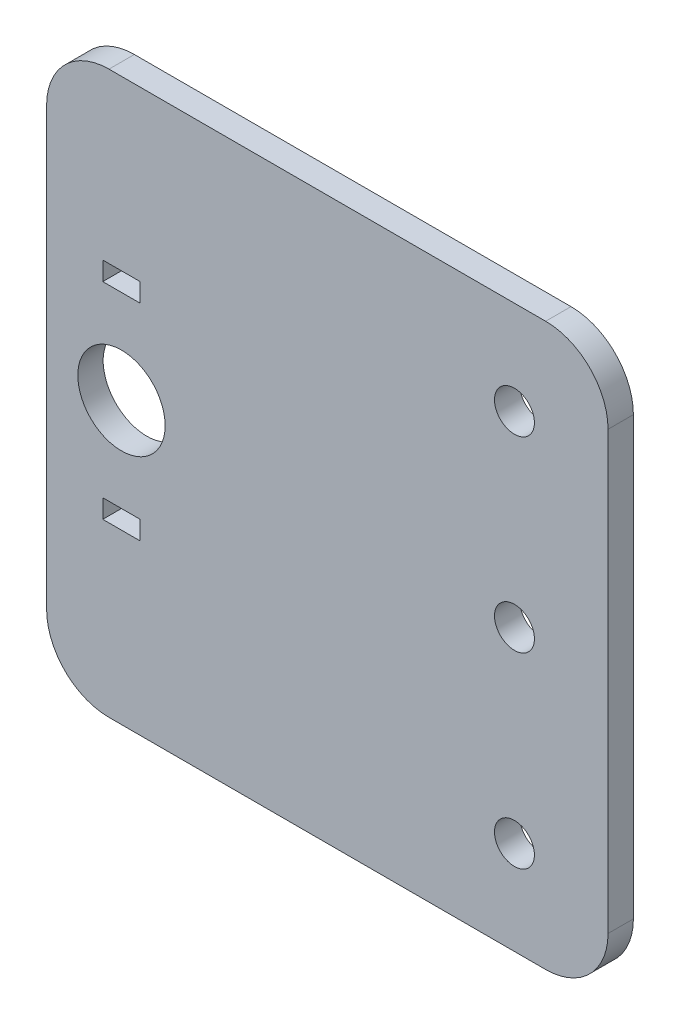
ISO-10303-21;
HEADER;
FILE_DESCRIPTION(('STEP AP214'),'2;1');
FILE_NAME('part.step','',(''),(''),'','','');
FILE_SCHEMA(('AUTOMOTIVE_DESIGN { 1 0 10303 214 1 1 1 1 }'));
ENDSEC;
DATA;
#1=APPLICATION_CONTEXT('core data for automotive mechanical design processes');
#2=APPLICATION_PROTOCOL_DEFINITION('international standard','automotive_design',2000,#1);
#3=PRODUCT_CONTEXT('',#1,'mechanical');
#4=PRODUCT('Part','Part','',(#3));
#5=PRODUCT_RELATED_PRODUCT_CATEGORY('part','',(#4));
#6=PRODUCT_DEFINITION_FORMATION('','',#4);
#7=PRODUCT_DEFINITION_CONTEXT('part definition',#1,'design');
#8=PRODUCT_DEFINITION('design','',#6,#7);
#9=PRODUCT_DEFINITION_SHAPE('','',#8);
#10=(LENGTH_UNIT() NAMED_UNIT(*) SI_UNIT(.MILLI.,.METRE.));
#11=(NAMED_UNIT(*) PLANE_ANGLE_UNIT() SI_UNIT($,.RADIAN.));
#12=(NAMED_UNIT(*) SI_UNIT($,.STERADIAN.) SOLID_ANGLE_UNIT());
#13=UNCERTAINTY_MEASURE_WITH_UNIT(LENGTH_MEASURE(1.E-05),#10,'distance_accuracy_value','');
#14=(GEOMETRIC_REPRESENTATION_CONTEXT(3) GLOBAL_UNCERTAINTY_ASSIGNED_CONTEXT((#13)) GLOBAL_UNIT_ASSIGNED_CONTEXT((#10,
#11,#12)) REPRESENTATION_CONTEXT('',''));
#15=CARTESIAN_POINT('',(0.,0.,0.));
#16=DIRECTION('',(0.,0.,1.));
#17=DIRECTION('',(1.,0.,0.));
#18=AXIS2_PLACEMENT_3D('',#15,#16,#17);
#19=CARTESIAN_POINT('',(0.,0.,2.032));
#20=DIRECTION('',(0.,0.,-1.));
#21=DIRECTION('',(-1.,0.,0.));
#22=AXIS2_PLACEMENT_3D('',#19,#20,#21);
#23=PLANE('',#22);
#24=DIRECTION('',(-1.,0.,0.));
#25=VECTOR('',#24,1.);
#26=CARTESIAN_POINT('',(1.5,9.,2.032));
#27=LINE('',#26,#25);
#28=CARTESIAN_POINT('',(1.5,9.,2.032));
#29=VERTEX_POINT('',#28);
#30=CARTESIAN_POINT('',(-1.5,9.,2.032));
#31=VERTEX_POINT('',#30);
#32=EDGE_CURVE('E177',#29,#31,#27,.T.);
#33=ORIENTED_EDGE('',*,*,#32,.F.);
#34=DIRECTION('',(0.,-1.,0.));
#35=VECTOR('',#34,1.);
#36=CARTESIAN_POINT('',(1.5,9.,2.032));
#37=LINE('',#36,#35);
#38=CARTESIAN_POINT('',(1.5,7.5,2.032));
#39=VERTEX_POINT('',#38);
#40=EDGE_CURVE('E185',#29,#39,#37,.T.);
#41=ORIENTED_EDGE('',*,*,#40,.T.);
#42=DIRECTION('',(-1.,0.,0.));
#43=VECTOR('',#42,1.);
#44=CARTESIAN_POINT('',(1.5,7.5,2.032));
#45=LINE('',#44,#43);
#46=CARTESIAN_POINT('',(-1.5,7.5,2.032));
#47=VERTEX_POINT('',#46);
#48=EDGE_CURVE('E182',#39,#47,#45,.T.);
#49=ORIENTED_EDGE('',*,*,#48,.T.);
#50=DIRECTION('',(0.,-1.,0.));
#51=VECTOR('',#50,1.);
#52=CARTESIAN_POINT('',(-1.5,9.,2.032));
#53=LINE('',#52,#51);
#54=EDGE_CURVE('E179',#31,#47,#53,.T.);
#55=ORIENTED_EDGE('',*,*,#54,.F.);
#56=EDGE_LOOP('',(#33,#41,#49,#55));
#57=FACE_BOUND('',#56,.T.);
#58=CARTESIAN_POINT('',(31.5,-15.,2.032));
#59=DIRECTION('',(0.,0.,-1.));
#60=DIRECTION('',(-1.,0.,0.));
#61=AXIS2_PLACEMENT_3D('',#58,#59,#60);
#62=CIRCLE('',#61,1.6);
#63=CARTESIAN_POINT('',(29.9,-15.,2.032));
#64=VERTEX_POINT('',#63);
#65=EDGE_CURVE('E209',#64,#64,#62,.T.);
#66=ORIENTED_EDGE('',*,*,#65,.T.);
#67=EDGE_LOOP('',(#66));
#68=FACE_BOUND('',#67,.T.);
#69=CARTESIAN_POINT('',(31.5,0.,2.032));
#70=DIRECTION('',(0.,0.,-1.));
#71=DIRECTION('',(-1.,0.,0.));
#72=AXIS2_PLACEMENT_3D('',#69,#70,#71);
#73=CIRCLE('',#72,1.6);
#74=CARTESIAN_POINT('',(29.9,0.,2.032));
#75=VERTEX_POINT('',#74);
#76=EDGE_CURVE('E215',#75,#75,#73,.T.);
#77=ORIENTED_EDGE('',*,*,#76,.T.);
#78=EDGE_LOOP('',(#77));
#79=FACE_BOUND('',#78,.T.);
#80=CARTESIAN_POINT('',(31.5,15.,2.032));
#81=DIRECTION('',(0.,0.,-1.));
#82=DIRECTION('',(-1.,0.,0.));
#83=AXIS2_PLACEMENT_3D('',#80,#81,#82);
#84=CIRCLE('',#83,1.6);
#85=CARTESIAN_POINT('',(29.9,15.,2.032));
#86=VERTEX_POINT('',#85);
#87=EDGE_CURVE('E221',#86,#86,#84,.T.);
#88=ORIENTED_EDGE('',*,*,#87,.T.);
#89=EDGE_LOOP('',(#88));
#90=FACE_BOUND('',#89,.T.);
#91=DIRECTION('',(0.,1.,0.));
#92=VECTOR('',#91,1.);
#93=CARTESIAN_POINT('',(39.,-22.5,2.032));
#94=LINE('',#93,#92);
#95=CARTESIAN_POINT('',(39.,-17.5,2.032));
#96=VERTEX_POINT('',#95);
#97=CARTESIAN_POINT('',(39.,17.5,2.032));
#98=VERTEX_POINT('',#97);
#99=EDGE_CURVE('E233',#96,#98,#94,.T.);
#100=ORIENTED_EDGE('',*,*,#99,.T.);
#101=CARTESIAN_POINT('',(34.,17.5,2.032));
#102=DIRECTION('',(0.,0.,-1.));
#103=DIRECTION('',(-1.,0.,0.));
#104=AXIS2_PLACEMENT_3D('',#101,#102,#103);
#105=CIRCLE('',#104,5.);
#106=CARTESIAN_POINT('',(34.,22.5,2.032));
#107=VERTEX_POINT('',#106);
#108=EDGE_CURVE('E280',#98,#107,#105,.F.);
#109=ORIENTED_EDGE('',*,*,#108,.T.);
#110=DIRECTION('',(-1.,0.,0.));
#111=VECTOR('',#110,1.);
#112=CARTESIAN_POINT('',(-6.,22.5,2.032));
#113=LINE('',#112,#111);
#114=CARTESIAN_POINT('',(-1.,22.5,2.032));
#115=VERTEX_POINT('',#114);
#116=EDGE_CURVE('E236',#107,#115,#113,.T.);
#117=ORIENTED_EDGE('',*,*,#116,.T.);
#118=CARTESIAN_POINT('',(-0.999999999999998,17.5,2.032));
#119=DIRECTION('',(0.,0.,-1.));
#120=DIRECTION('',(-1.,0.,0.));
#121=AXIS2_PLACEMENT_3D('',#118,#119,#120);
#122=CIRCLE('',#121,5.);
#123=CARTESIAN_POINT('',(-6.,17.5,2.032));
#124=VERTEX_POINT('',#123);
#125=EDGE_CURVE('E274',#115,#124,#122,.F.);
#126=ORIENTED_EDGE('',*,*,#125,.T.);
#127=DIRECTION('',(0.,-1.,0.));
#128=VECTOR('',#127,1.);
#129=CARTESIAN_POINT('',(-6.,-22.5,2.032));
#130=LINE('',#129,#128);
#131=CARTESIAN_POINT('',(-6.,-17.5,2.032));
#132=VERTEX_POINT('',#131);
#133=EDGE_CURVE('E240',#124,#132,#130,.T.);
#134=ORIENTED_EDGE('',*,*,#133,.T.);
#135=CARTESIAN_POINT('',(-0.999999999999998,-17.5,2.032));
#136=DIRECTION('',(0.,0.,-1.));
#137=DIRECTION('',(-1.,0.,0.));
#138=AXIS2_PLACEMENT_3D('',#135,#136,#137);
#139=CIRCLE('',#138,5.);
#140=CARTESIAN_POINT('',(-1.,-22.5,2.032));
#141=VERTEX_POINT('',#140);
#142=EDGE_CURVE('E276',#132,#141,#139,.F.);
#143=ORIENTED_EDGE('',*,*,#142,.T.);
#144=DIRECTION('',(1.,0.,0.));
#145=VECTOR('',#144,1.);
#146=CARTESIAN_POINT('',(-6.,-22.5,2.032));
#147=LINE('',#146,#145);
#148=CARTESIAN_POINT('',(34.,-22.5,2.032));
#149=VERTEX_POINT('',#148);
#150=EDGE_CURVE('E243',#141,#149,#147,.T.);
#151=ORIENTED_EDGE('',*,*,#150,.T.);
#152=CARTESIAN_POINT('',(34.,-17.5,2.032));
#153=DIRECTION('',(0.,0.,-1.));
#154=DIRECTION('',(-1.,0.,0.));
#155=AXIS2_PLACEMENT_3D('',#152,#153,#154);
#156=CIRCLE('',#155,5.);
#157=EDGE_CURVE('E278',#149,#96,#156,.F.);
#158=ORIENTED_EDGE('',*,*,#157,.T.);
#159=EDGE_LOOP('',(#100,#109,#117,#126,#134,#143,#151,#158));
#160=FACE_BOUND('',#159,.T.);
#161=CARTESIAN_POINT('',(0.,0.,2.032));
#162=DIRECTION('',(0.,0.,1.));
#163=DIRECTION('',(1.,0.,0.));
#164=AXIS2_PLACEMENT_3D('',#161,#162,#163);
#165=CIRCLE('',#164,3.5);
#166=CARTESIAN_POINT('',(3.50000000000001,0.,2.032));
#167=VERTEX_POINT('',#166);
#168=EDGE_CURVE('E227',#167,#167,#165,.T.);
#169=ORIENTED_EDGE('',*,*,#168,.F.);
#170=EDGE_LOOP('',(#169));
#171=FACE_BOUND('',#170,.T.);
#172=DIRECTION('',(-1.,0.,0.));
#173=VECTOR('',#172,1.);
#174=CARTESIAN_POINT('',(1.5,-7.5,2.032));
#175=LINE('',#174,#173);
#176=CARTESIAN_POINT('',(1.5,-7.5,2.032));
#177=VERTEX_POINT('',#176);
#178=CARTESIAN_POINT('',(-1.50000000000001,-7.5,2.032));
#179=VERTEX_POINT('',#178);
#180=EDGE_CURVE('E161',#177,#179,#175,.T.);
#181=ORIENTED_EDGE('',*,*,#180,.F.);
#182=DIRECTION('',(0.,-1.,0.));
#183=VECTOR('',#182,1.);
#184=CARTESIAN_POINT('',(1.5,-7.5,2.032));
#185=LINE('',#184,#183);
#186=CARTESIAN_POINT('',(1.5,-9.,2.032));
#187=VERTEX_POINT('',#186);
#188=EDGE_CURVE('E171',#177,#187,#185,.T.);
#189=ORIENTED_EDGE('',*,*,#188,.T.);
#190=DIRECTION('',(-1.,0.,0.));
#191=VECTOR('',#190,1.);
#192=CARTESIAN_POINT('',(1.5,-9.,2.032));
#193=LINE('',#192,#191);
#194=CARTESIAN_POINT('',(-1.5,-9.,2.032));
#195=VERTEX_POINT('',#194);
#196=EDGE_CURVE('E48',#187,#195,#193,.T.);
#197=ORIENTED_EDGE('',*,*,#196,.T.);
#198=DIRECTION('',(0.,-1.,0.));
#199=VECTOR('',#198,1.);
#200=CARTESIAN_POINT('',(-1.50000000000001,-7.5,2.032));
#201=LINE('',#200,#199);
#202=EDGE_CURVE('E174',#179,#195,#201,.T.);
#203=ORIENTED_EDGE('',*,*,#202,.F.);
#204=EDGE_LOOP('',(#181,#189,#197,#203));
#205=FACE_BOUND('',#204,.T.);
#206=ADVANCED_FACE('F33',(#57,#68,#79,#90,#160,#171,#205),#23,.F.);
#207=CARTESIAN_POINT('',(0.,0.,0.));
#208=DIRECTION('',(0.,0.,-1.));
#209=DIRECTION('',(-1.,0.,0.));
#210=AXIS2_PLACEMENT_3D('',#207,#208,#209);
#211=PLANE('',#210);
#212=DIRECTION('',(0.,-1.,0.));
#213=VECTOR('',#212,1.);
#214=CARTESIAN_POINT('',(1.5,9.,0.));
#215=LINE('',#214,#213);
#216=CARTESIAN_POINT('',(1.5,9.,0.));
#217=VERTEX_POINT('',#216);
#218=CARTESIAN_POINT('',(1.5,7.5,0.));
#219=VERTEX_POINT('',#218);
#220=EDGE_CURVE('E180',#217,#219,#215,.T.);
#221=ORIENTED_EDGE('',*,*,#220,.F.);
#222=DIRECTION('',(-1.,0.,0.));
#223=VECTOR('',#222,1.);
#224=CARTESIAN_POINT('',(1.5,9.,0.));
#225=LINE('',#224,#223);
#226=CARTESIAN_POINT('',(-1.5,9.,0.));
#227=VERTEX_POINT('',#226);
#228=EDGE_CURVE('E170',#217,#227,#225,.T.);
#229=ORIENTED_EDGE('',*,*,#228,.T.);
#230=DIRECTION('',(0.,-1.,0.));
#231=VECTOR('',#230,1.);
#232=CARTESIAN_POINT('',(-1.5,9.,0.));
#233=LINE('',#232,#231);
#234=CARTESIAN_POINT('',(-1.5,7.5,0.));
#235=VERTEX_POINT('',#234);
#236=EDGE_CURVE('E191',#227,#235,#233,.T.);
#237=ORIENTED_EDGE('',*,*,#236,.T.);
#238=DIRECTION('',(-1.,0.,0.));
#239=VECTOR('',#238,1.);
#240=CARTESIAN_POINT('',(1.5,7.5,0.));
#241=LINE('',#240,#239);
#242=EDGE_CURVE('E194',#219,#235,#241,.T.);
#243=ORIENTED_EDGE('',*,*,#242,.F.);
#244=EDGE_LOOP('',(#221,#229,#237,#243));
#245=FACE_BOUND('',#244,.T.);
#246=CARTESIAN_POINT('',(31.5,-15.,0.));
#247=DIRECTION('',(0.,0.,-1.));
#248=DIRECTION('',(-1.,0.,0.));
#249=AXIS2_PLACEMENT_3D('',#246,#247,#248);
#250=CIRCLE('',#249,1.6);
#251=CARTESIAN_POINT('',(29.9,-15.,0.));
#252=VERTEX_POINT('',#251);
#253=EDGE_CURVE('E208',#252,#252,#250,.T.);
#254=ORIENTED_EDGE('',*,*,#253,.F.);
#255=EDGE_LOOP('',(#254));
#256=FACE_BOUND('',#255,.T.);
#257=CARTESIAN_POINT('',(31.5,0.,0.));
#258=DIRECTION('',(0.,0.,-1.));
#259=DIRECTION('',(-1.,0.,0.));
#260=AXIS2_PLACEMENT_3D('',#257,#258,#259);
#261=CIRCLE('',#260,1.6);
#262=CARTESIAN_POINT('',(29.9,0.,0.));
#263=VERTEX_POINT('',#262);
#264=EDGE_CURVE('E212',#263,#263,#261,.T.);
#265=ORIENTED_EDGE('',*,*,#264,.F.);
#266=EDGE_LOOP('',(#265));
#267=FACE_BOUND('',#266,.T.);
#268=CARTESIAN_POINT('',(31.5,15.,0.));
#269=DIRECTION('',(0.,0.,-1.));
#270=DIRECTION('',(-1.,0.,0.));
#271=AXIS2_PLACEMENT_3D('',#268,#269,#270);
#272=CIRCLE('',#271,1.6);
#273=CARTESIAN_POINT('',(29.9,15.,0.));
#274=VERTEX_POINT('',#273);
#275=EDGE_CURVE('E218',#274,#274,#272,.T.);
#276=ORIENTED_EDGE('',*,*,#275,.F.);
#277=EDGE_LOOP('',(#276));
#278=FACE_BOUND('',#277,.T.);
#279=DIRECTION('',(-1.,0.,0.));
#280=VECTOR('',#279,1.);
#281=CARTESIAN_POINT('',(-6.,22.5,0.));
#282=LINE('',#281,#280);
#283=CARTESIAN_POINT('',(34.,22.5,0.));
#284=VERTEX_POINT('',#283);
#285=CARTESIAN_POINT('',(-1.,22.5,0.));
#286=VERTEX_POINT('',#285);
#287=EDGE_CURVE('E249',#284,#286,#282,.T.);
#288=ORIENTED_EDGE('',*,*,#287,.F.);
#289=CARTESIAN_POINT('',(34.,17.5,0.));
#290=DIRECTION('',(0.,0.,-1.));
#291=DIRECTION('',(-1.,0.,0.));
#292=AXIS2_PLACEMENT_3D('',#289,#290,#291);
#293=CIRCLE('',#292,5.);
#294=CARTESIAN_POINT('',(39.,17.5,0.));
#295=VERTEX_POINT('',#294);
#296=EDGE_CURVE('E267',#284,#295,#293,.T.);
#297=ORIENTED_EDGE('',*,*,#296,.T.);
#298=DIRECTION('',(0.,1.,0.));
#299=VECTOR('',#298,1.);
#300=CARTESIAN_POINT('',(39.,-22.5,0.));
#301=LINE('',#300,#299);
#302=CARTESIAN_POINT('',(39.,-17.5,0.));
#303=VERTEX_POINT('',#302);
#304=EDGE_CURVE('E230',#303,#295,#301,.T.);
#305=ORIENTED_EDGE('',*,*,#304,.F.);
#306=CARTESIAN_POINT('',(34.,-17.5,0.));
#307=DIRECTION('',(0.,0.,-1.));
#308=DIRECTION('',(-1.,0.,0.));
#309=AXIS2_PLACEMENT_3D('',#306,#307,#308);
#310=CIRCLE('',#309,5.);
#311=CARTESIAN_POINT('',(34.,-22.5,0.));
#312=VERTEX_POINT('',#311);
#313=EDGE_CURVE('E265',#303,#312,#310,.T.);
#314=ORIENTED_EDGE('',*,*,#313,.T.);
#315=DIRECTION('',(1.,0.,0.));
#316=VECTOR('',#315,1.);
#317=CARTESIAN_POINT('',(-6.,-22.5,0.));
#318=LINE('',#317,#316);
#319=CARTESIAN_POINT('',(-1.,-22.5,0.));
#320=VERTEX_POINT('',#319);
#321=EDGE_CURVE('E237',#320,#312,#318,.T.);
#322=ORIENTED_EDGE('',*,*,#321,.F.);
#323=CARTESIAN_POINT('',(-0.999999999999998,-17.5,0.));
#324=DIRECTION('',(0.,0.,-1.));
#325=DIRECTION('',(-1.,0.,0.));
#326=AXIS2_PLACEMENT_3D('',#323,#324,#325);
#327=CIRCLE('',#326,5.);
#328=CARTESIAN_POINT('',(-6.,-17.5,0.));
#329=VERTEX_POINT('',#328);
#330=EDGE_CURVE('E263',#320,#329,#327,.T.);
#331=ORIENTED_EDGE('',*,*,#330,.T.);
#332=DIRECTION('',(0.,-1.,0.));
#333=VECTOR('',#332,1.);
#334=CARTESIAN_POINT('',(-6.,-22.5,0.));
#335=LINE('',#334,#333);
#336=CARTESIAN_POINT('',(-6.,17.5,0.));
#337=VERTEX_POINT('',#336);
#338=EDGE_CURVE('E252',#337,#329,#335,.T.);
#339=ORIENTED_EDGE('',*,*,#338,.F.);
#340=CARTESIAN_POINT('',(-0.999999999999998,17.5,0.));
#341=DIRECTION('',(0.,0.,-1.));
#342=DIRECTION('',(-1.,0.,0.));
#343=AXIS2_PLACEMENT_3D('',#340,#341,#342);
#344=CIRCLE('',#343,5.);
#345=EDGE_CURVE('E261',#337,#286,#344,.T.);
#346=ORIENTED_EDGE('',*,*,#345,.T.);
#347=EDGE_LOOP('',(#288,#297,#305,#314,#322,#331,#339,#346));
#348=FACE_BOUND('',#347,.T.);
#349=CARTESIAN_POINT('',(0.,0.,0.));
#350=DIRECTION('',(0.,0.,1.));
#351=DIRECTION('',(1.,0.,0.));
#352=AXIS2_PLACEMENT_3D('',#349,#350,#351);
#353=CIRCLE('',#352,3.5);
#354=CARTESIAN_POINT('',(3.50000000000001,0.,0.));
#355=VERTEX_POINT('',#354);
#356=EDGE_CURVE('E224',#355,#355,#353,.T.);
#357=ORIENTED_EDGE('',*,*,#356,.T.);
#358=EDGE_LOOP('',(#357));
#359=FACE_BOUND('',#358,.T.);
#360=DIRECTION('',(0.,-1.,0.));
#361=VECTOR('',#360,1.);
#362=CARTESIAN_POINT('',(1.5,-7.5,0.));
#363=LINE('',#362,#361);
#364=CARTESIAN_POINT('',(1.5,-7.5,0.));
#365=VERTEX_POINT('',#364);
#366=CARTESIAN_POINT('',(1.5,-9.,0.));
#367=VERTEX_POINT('',#366);
#368=EDGE_CURVE('E158',#365,#367,#363,.T.);
#369=ORIENTED_EDGE('',*,*,#368,.F.);
#370=DIRECTION('',(-1.,0.,0.));
#371=VECTOR('',#370,1.);
#372=CARTESIAN_POINT('',(1.5,-7.5,0.));
#373=LINE('',#372,#371);
#374=CARTESIAN_POINT('',(-1.50000000000001,-7.5,0.));
#375=VERTEX_POINT('',#374);
#376=EDGE_CURVE('E56',#365,#375,#373,.T.);
#377=ORIENTED_EDGE('',*,*,#376,.T.);
#378=DIRECTION('',(0.,-1.,0.));
#379=VECTOR('',#378,1.);
#380=CARTESIAN_POINT('',(-1.50000000000001,-7.5,0.));
#381=LINE('',#380,#379);
#382=CARTESIAN_POINT('',(-1.5,-9.,0.));
#383=VERTEX_POINT('',#382);
#384=EDGE_CURVE('E164',#375,#383,#381,.T.);
#385=ORIENTED_EDGE('',*,*,#384,.T.);
#386=DIRECTION('',(-1.,0.,0.));
#387=VECTOR('',#386,1.);
#388=CARTESIAN_POINT('',(1.5,-9.,0.));
#389=LINE('',#388,#387);
#390=EDGE_CURVE('E149',#367,#383,#389,.T.);
#391=ORIENTED_EDGE('',*,*,#390,.F.);
#392=EDGE_LOOP('',(#369,#377,#385,#391));
#393=FACE_BOUND('',#392,.T.);
#394=ADVANCED_FACE('F163',(#245,#256,#267,#278,#348,#359,#393),#211,.T.);
#395=CARTESIAN_POINT('',(39.,-22.5,2.032));
#396=DIRECTION('',(-1.,0.,0.));
#397=DIRECTION('',(0.,0.,1.));
#398=AXIS2_PLACEMENT_3D('',#395,#396,#397);
#399=PLANE('',#398);
#400=ORIENTED_EDGE('',*,*,#304,.T.);
#401=DIRECTION('',(0.,0.,-1.));
#402=VECTOR('',#401,1.);
#403=CARTESIAN_POINT('',(39.,17.5,2.032));
#404=LINE('',#403,#402);
#405=EDGE_CURVE('E272',#295,#98,#404,.F.);
#406=ORIENTED_EDGE('',*,*,#405,.T.);
#407=ORIENTED_EDGE('',*,*,#99,.F.);
#408=DIRECTION('',(0.,0.,-1.));
#409=VECTOR('',#408,1.);
#410=CARTESIAN_POINT('',(39.,-17.5,2.032));
#411=LINE('',#410,#409);
#412=EDGE_CURVE('E269',#96,#303,#411,.T.);
#413=ORIENTED_EDGE('',*,*,#412,.T.);
#414=EDGE_LOOP('',(#400,#406,#407,#413));
#415=FACE_BOUND('',#414,.T.);
#416=ADVANCED_FACE('F316',(#415),#399,.F.);
#417=CARTESIAN_POINT('',(-6.,22.5,2.032));
#418=DIRECTION('',(0.,-1.,0.));
#419=DIRECTION('',(0.,0.,-1.));
#420=AXIS2_PLACEMENT_3D('',#417,#418,#419);
#421=PLANE('',#420);
#422=ORIENTED_EDGE('',*,*,#116,.F.);
#423=DIRECTION('',(0.,0.,-1.));
#424=VECTOR('',#423,1.);
#425=CARTESIAN_POINT('',(34.,22.5,2.032));
#426=LINE('',#425,#424);
#427=EDGE_CURVE('E258',#107,#284,#426,.T.);
#428=ORIENTED_EDGE('',*,*,#427,.T.);
#429=ORIENTED_EDGE('',*,*,#287,.T.);
#430=DIRECTION('',(0.,0.,-1.));
#431=VECTOR('',#430,1.);
#432=CARTESIAN_POINT('',(-0.999999999999998,22.5,2.032));
#433=LINE('',#432,#431);
#434=EDGE_CURVE('E246',#286,#115,#433,.F.);
#435=ORIENTED_EDGE('',*,*,#434,.T.);
#436=EDGE_LOOP('',(#422,#428,#429,#435));
#437=FACE_BOUND('',#436,.T.);
#438=ADVANCED_FACE('F324',(#437),#421,.F.);
#439=CARTESIAN_POINT('',(-6.,-22.5,2.032));
#440=DIRECTION('',(1.,0.,0.));
#441=DIRECTION('',(0.,0.,-1.));
#442=AXIS2_PLACEMENT_3D('',#439,#440,#441);
#443=PLANE('',#442);
#444=ORIENTED_EDGE('',*,*,#338,.T.);
#445=DIRECTION('',(0.,0.,-1.));
#446=VECTOR('',#445,1.);
#447=CARTESIAN_POINT('',(-6.,-17.5,2.032));
#448=LINE('',#447,#446);
#449=EDGE_CURVE('E11',#329,#132,#448,.F.);
#450=ORIENTED_EDGE('',*,*,#449,.T.);
#451=ORIENTED_EDGE('',*,*,#133,.F.);
#452=DIRECTION('',(0.,0.,-1.));
#453=VECTOR('',#452,1.);
#454=CARTESIAN_POINT('',(-6.,17.5,2.032));
#455=LINE('',#454,#453);
#456=EDGE_CURVE('E41',#124,#337,#455,.T.);
#457=ORIENTED_EDGE('',*,*,#456,.T.);
#458=EDGE_LOOP('',(#444,#450,#451,#457));
#459=FACE_BOUND('',#458,.T.);
#460=ADVANCED_FACE('F291',(#459),#443,.F.);
#461=CARTESIAN_POINT('',(-6.,-22.5,2.032));
#462=DIRECTION('',(0.,1.,0.));
#463=DIRECTION('',(0.,0.,1.));
#464=AXIS2_PLACEMENT_3D('',#461,#462,#463);
#465=PLANE('',#464);
#466=ORIENTED_EDGE('',*,*,#321,.T.);
#467=DIRECTION('',(0.,0.,-1.));
#468=VECTOR('',#467,1.);
#469=CARTESIAN_POINT('',(34.,-22.5,2.032));
#470=LINE('',#469,#468);
#471=EDGE_CURVE('E285',#312,#149,#470,.F.);
#472=ORIENTED_EDGE('',*,*,#471,.T.);
#473=ORIENTED_EDGE('',*,*,#150,.F.);
#474=DIRECTION('',(0.,0.,-1.));
#475=VECTOR('',#474,1.);
#476=CARTESIAN_POINT('',(-0.999999999999998,-22.5,2.032));
#477=LINE('',#476,#475);
#478=EDGE_CURVE('E282',#141,#320,#477,.T.);
#479=ORIENTED_EDGE('',*,*,#478,.T.);
#480=EDGE_LOOP('',(#466,#472,#473,#479));
#481=FACE_BOUND('',#480,.T.);
#482=ADVANCED_FACE('F305',(#481),#465,.F.);
#483=CARTESIAN_POINT('',(0.,0.,2.032));
#484=DIRECTION('',(0.,0.,-1.));
#485=DIRECTION('',(-1.,0.,0.));
#486=AXIS2_PLACEMENT_3D('',#483,#484,#485);
#487=CYLINDRICAL_SURFACE('',#486,3.5);
#488=ORIENTED_EDGE('',*,*,#168,.T.);
#489=EDGE_LOOP('',(#488));
#490=FACE_BOUND('',#489,.T.);
#491=ORIENTED_EDGE('',*,*,#356,.F.);
#492=EDGE_LOOP('',(#491));
#493=FACE_BOUND('',#492,.T.);
#494=ADVANCED_FACE('F346',(#490,#493),#487,.F.);
#495=CARTESIAN_POINT('',(34.,17.5,2.032));
#496=DIRECTION('',(0.,0.,-1.));
#497=DIRECTION('',(-1.,0.,0.));
#498=AXIS2_PLACEMENT_3D('',#495,#496,#497);
#499=CYLINDRICAL_SURFACE('',#498,5.);
#500=ORIENTED_EDGE('',*,*,#108,.F.);
#501=ORIENTED_EDGE('',*,*,#405,.F.);
#502=ORIENTED_EDGE('',*,*,#296,.F.);
#503=ORIENTED_EDGE('',*,*,#427,.F.);
#504=EDGE_LOOP('',(#500,#501,#502,#503));
#505=FACE_BOUND('',#504,.T.);
#506=ADVANCED_FACE('F321',(#505),#499,.T.);
#507=CARTESIAN_POINT('',(34.,-17.5,2.032));
#508=DIRECTION('',(0.,0.,-1.));
#509=DIRECTION('',(-1.,0.,0.));
#510=AXIS2_PLACEMENT_3D('',#507,#508,#509);
#511=CYLINDRICAL_SURFACE('',#510,5.);
#512=ORIENTED_EDGE('',*,*,#157,.F.);
#513=ORIENTED_EDGE('',*,*,#471,.F.);
#514=ORIENTED_EDGE('',*,*,#313,.F.);
#515=ORIENTED_EDGE('',*,*,#412,.F.);
#516=EDGE_LOOP('',(#512,#513,#514,#515));
#517=FACE_BOUND('',#516,.T.);
#518=ADVANCED_FACE('F313',(#517),#511,.T.);
#519=CARTESIAN_POINT('',(-0.999999999999998,-17.5,2.032));
#520=DIRECTION('',(0.,0.,-1.));
#521=DIRECTION('',(-1.,0.,0.));
#522=AXIS2_PLACEMENT_3D('',#519,#520,#521);
#523=CYLINDRICAL_SURFACE('',#522,5.);
#524=ORIENTED_EDGE('',*,*,#142,.F.);
#525=ORIENTED_EDGE('',*,*,#449,.F.);
#526=ORIENTED_EDGE('',*,*,#330,.F.);
#527=ORIENTED_EDGE('',*,*,#478,.F.);
#528=EDGE_LOOP('',(#524,#525,#526,#527));
#529=FACE_BOUND('',#528,.T.);
#530=ADVANCED_FACE('F302',(#529),#523,.T.);
#531=CARTESIAN_POINT('',(-0.999999999999998,17.5,2.032));
#532=DIRECTION('',(0.,0.,-1.));
#533=DIRECTION('',(-1.,0.,0.));
#534=AXIS2_PLACEMENT_3D('',#531,#532,#533);
#535=CYLINDRICAL_SURFACE('',#534,5.);
#536=ORIENTED_EDGE('',*,*,#125,.F.);
#537=ORIENTED_EDGE('',*,*,#434,.F.);
#538=ORIENTED_EDGE('',*,*,#345,.F.);
#539=ORIENTED_EDGE('',*,*,#456,.F.);
#540=EDGE_LOOP('',(#536,#537,#538,#539));
#541=FACE_BOUND('',#540,.T.);
#542=ADVANCED_FACE('F35',(#541),#535,.T.);
#543=CARTESIAN_POINT('',(31.5,15.,2.032));
#544=DIRECTION('',(0.,0.,-1.));
#545=DIRECTION('',(-1.,0.,0.));
#546=AXIS2_PLACEMENT_3D('',#543,#544,#545);
#547=CYLINDRICAL_SURFACE('',#546,1.6);
#548=ORIENTED_EDGE('',*,*,#87,.F.);
#549=EDGE_LOOP('',(#548));
#550=FACE_BOUND('',#549,.T.);
#551=ORIENTED_EDGE('',*,*,#275,.T.);
#552=EDGE_LOOP('',(#551));
#553=FACE_BOUND('',#552,.T.);
#554=ADVANCED_FACE('F327',(#550,#553),#547,.F.);
#555=CARTESIAN_POINT('',(31.5,0.,2.032));
#556=DIRECTION('',(0.,0.,-1.));
#557=DIRECTION('',(-1.,0.,0.));
#558=AXIS2_PLACEMENT_3D('',#555,#556,#557);
#559=CYLINDRICAL_SURFACE('',#558,1.6);
#560=ORIENTED_EDGE('',*,*,#76,.F.);
#561=EDGE_LOOP('',(#560));
#562=FACE_BOUND('',#561,.T.);
#563=ORIENTED_EDGE('',*,*,#264,.T.);
#564=EDGE_LOOP('',(#563));
#565=FACE_BOUND('',#564,.T.);
#566=ADVANCED_FACE('F332',(#562,#565),#559,.F.);
#567=CARTESIAN_POINT('',(31.5,-15.,2.032));
#568=DIRECTION('',(0.,0.,-1.));
#569=DIRECTION('',(-1.,0.,0.));
#570=AXIS2_PLACEMENT_3D('',#567,#568,#569);
#571=CYLINDRICAL_SURFACE('',#570,1.6);
#572=ORIENTED_EDGE('',*,*,#65,.F.);
#573=EDGE_LOOP('',(#572));
#574=FACE_BOUND('',#573,.T.);
#575=ORIENTED_EDGE('',*,*,#253,.T.);
#576=EDGE_LOOP('',(#575));
#577=FACE_BOUND('',#576,.T.);
#578=ADVANCED_FACE('F387',(#574,#577),#571,.F.);
#579=CARTESIAN_POINT('',(1.5,9.,2.032));
#580=DIRECTION('',(0.,-1.,0.));
#581=DIRECTION('',(0.,0.,-1.));
#582=AXIS2_PLACEMENT_3D('',#579,#580,#581);
#583=PLANE('',#582);
#584=ORIENTED_EDGE('',*,*,#228,.F.);
#585=DIRECTION('',(0.,0.,-1.));
#586=VECTOR('',#585,1.);
#587=CARTESIAN_POINT('',(1.5,9.,2.032));
#588=LINE('',#587,#586);
#589=EDGE_CURVE('E188',#29,#217,#588,.T.);
#590=ORIENTED_EDGE('',*,*,#589,.F.);
#591=ORIENTED_EDGE('',*,*,#32,.T.);
#592=DIRECTION('',(0.,0.,-1.));
#593=VECTOR('',#592,1.);
#594=CARTESIAN_POINT('',(-1.5,9.,2.032));
#595=LINE('',#594,#593);
#596=EDGE_CURVE('E205',#31,#227,#595,.T.);
#597=ORIENTED_EDGE('',*,*,#596,.T.);
#598=EDGE_LOOP('',(#584,#590,#591,#597));
#599=FACE_BOUND('',#598,.T.);
#600=ADVANCED_FACE('F396',(#599),#583,.T.);
#601=CARTESIAN_POINT('',(-1.5,9.,2.032));
#602=DIRECTION('',(1.,0.,0.));
#603=DIRECTION('',(0.,1.,0.));
#604=AXIS2_PLACEMENT_3D('',#601,#602,#603);
#605=PLANE('',#604);
#606=ORIENTED_EDGE('',*,*,#236,.F.);
#607=ORIENTED_EDGE('',*,*,#596,.F.);
#608=ORIENTED_EDGE('',*,*,#54,.T.);
#609=DIRECTION('',(0.,0.,-1.));
#610=VECTOR('',#609,1.);
#611=CARTESIAN_POINT('',(-1.5,7.5,2.032));
#612=LINE('',#611,#610);
#613=EDGE_CURVE('E203',#47,#235,#612,.T.);
#614=ORIENTED_EDGE('',*,*,#613,.T.);
#615=EDGE_LOOP('',(#606,#607,#608,#614));
#616=FACE_BOUND('',#615,.T.);
#617=ADVANCED_FACE('F417',(#616),#605,.T.);
#618=CARTESIAN_POINT('',(1.5,7.5,2.032));
#619=DIRECTION('',(0.,-1.,0.));
#620=DIRECTION('',(0.,0.,-1.));
#621=AXIS2_PLACEMENT_3D('',#618,#619,#620);
#622=PLANE('',#621);
#623=ORIENTED_EDGE('',*,*,#242,.T.);
#624=ORIENTED_EDGE('',*,*,#613,.F.);
#625=ORIENTED_EDGE('',*,*,#48,.F.);
#626=DIRECTION('',(0.,0.,-1.));
#627=VECTOR('',#626,1.);
#628=CARTESIAN_POINT('',(1.5,7.5,2.032));
#629=LINE('',#628,#627);
#630=EDGE_CURVE('E201',#39,#219,#629,.T.);
#631=ORIENTED_EDGE('',*,*,#630,.T.);
#632=EDGE_LOOP('',(#623,#624,#625,#631));
#633=FACE_BOUND('',#632,.T.);
#634=ADVANCED_FACE('F427',(#633),#622,.F.);
#635=CARTESIAN_POINT('',(1.5,9.,2.032));
#636=DIRECTION('',(1.,0.,0.));
#637=DIRECTION('',(0.,1.,0.));
#638=AXIS2_PLACEMENT_3D('',#635,#636,#637);
#639=PLANE('',#638);
#640=ORIENTED_EDGE('',*,*,#220,.T.);
#641=ORIENTED_EDGE('',*,*,#630,.F.);
#642=ORIENTED_EDGE('',*,*,#40,.F.);
#643=ORIENTED_EDGE('',*,*,#589,.T.);
#644=EDGE_LOOP('',(#640,#641,#642,#643));
#645=FACE_BOUND('',#644,.T.);
#646=ADVANCED_FACE('F437',(#645),#639,.F.);
#647=CARTESIAN_POINT('',(1.5,-7.5,2.032));
#648=DIRECTION('',(0.,-1.,0.));
#649=DIRECTION('',(0.,0.,-1.));
#650=AXIS2_PLACEMENT_3D('',#647,#648,#649);
#651=PLANE('',#650);
#652=ORIENTED_EDGE('',*,*,#376,.F.);
#653=DIRECTION('',(0.,0.,-1.));
#654=VECTOR('',#653,1.);
#655=CARTESIAN_POINT('',(1.5,-7.5,2.032));
#656=LINE('',#655,#654);
#657=EDGE_CURVE('E154',#177,#365,#656,.T.);
#658=ORIENTED_EDGE('',*,*,#657,.F.);
#659=ORIENTED_EDGE('',*,*,#180,.T.);
#660=DIRECTION('',(0.,0.,-1.));
#661=VECTOR('',#660,1.);
#662=CARTESIAN_POINT('',(-1.50000000000001,-7.5,2.032));
#663=LINE('',#662,#661);
#664=EDGE_CURVE('E487',#179,#375,#663,.T.);
#665=ORIENTED_EDGE('',*,*,#664,.T.);
#666=EDGE_LOOP('',(#652,#658,#659,#665));
#667=FACE_BOUND('',#666,.T.);
#668=ADVANCED_FACE('F447',(#667),#651,.T.);
#669=CARTESIAN_POINT('',(-1.50000000000001,-7.5,2.032));
#670=DIRECTION('',(1.,0.,0.));
#671=DIRECTION('',(0.,1.,0.));
#672=AXIS2_PLACEMENT_3D('',#669,#670,#671);
#673=PLANE('',#672);
#674=ORIENTED_EDGE('',*,*,#384,.F.);
#675=ORIENTED_EDGE('',*,*,#664,.F.);
#676=ORIENTED_EDGE('',*,*,#202,.T.);
#677=DIRECTION('',(0.,0.,-1.));
#678=VECTOR('',#677,1.);
#679=CARTESIAN_POINT('',(-1.5,-9.,2.032));
#680=LINE('',#679,#678);
#681=EDGE_CURVE('E155',#195,#383,#680,.T.);
#682=ORIENTED_EDGE('',*,*,#681,.T.);
#683=EDGE_LOOP('',(#674,#675,#676,#682));
#684=FACE_BOUND('',#683,.T.);
#685=ADVANCED_FACE('F457',(#684),#673,.T.);
#686=CARTESIAN_POINT('',(1.5,-9.,2.032));
#687=DIRECTION('',(0.,-1.,0.));
#688=DIRECTION('',(0.,0.,-1.));
#689=AXIS2_PLACEMENT_3D('',#686,#687,#688);
#690=PLANE('',#689);
#691=ORIENTED_EDGE('',*,*,#390,.T.);
#692=ORIENTED_EDGE('',*,*,#681,.F.);
#693=ORIENTED_EDGE('',*,*,#196,.F.);
#694=DIRECTION('',(0.,0.,-1.));
#695=VECTOR('',#694,1.);
#696=CARTESIAN_POINT('',(1.5,-9.,2.032));
#697=LINE('',#696,#695);
#698=EDGE_CURVE('E145',#187,#367,#697,.T.);
#699=ORIENTED_EDGE('',*,*,#698,.T.);
#700=EDGE_LOOP('',(#691,#692,#693,#699));
#701=FACE_BOUND('',#700,.T.);
#702=ADVANCED_FACE('F147',(#701),#690,.F.);
#703=CARTESIAN_POINT('',(1.5,-7.5,2.032));
#704=DIRECTION('',(1.,0.,0.));
#705=DIRECTION('',(0.,1.,0.));
#706=AXIS2_PLACEMENT_3D('',#703,#704,#705);
#707=PLANE('',#706);
#708=ORIENTED_EDGE('',*,*,#368,.T.);
#709=ORIENTED_EDGE('',*,*,#698,.F.);
#710=ORIENTED_EDGE('',*,*,#188,.F.);
#711=ORIENTED_EDGE('',*,*,#657,.T.);
#712=EDGE_LOOP('',(#708,#709,#710,#711));
#713=FACE_BOUND('',#712,.T.);
#714=ADVANCED_FACE('F159',(#713),#707,.F.);
#715=CLOSED_SHELL('',(#206,#394,#416,#438,#460,#482,#494,#506,#518,#530,#542,#554,#566,#578,
#600,#617,#634,#646,#668,#685,#702,#714));
#716=MANIFOLD_SOLID_BREP('B2',#715);
#717=ADVANCED_BREP_SHAPE_REPRESENTATION('',(#18,#716),#14);
#718=SHAPE_DEFINITION_REPRESENTATION(#9,#717);
ENDSEC;
END-ISO-10303-21;
